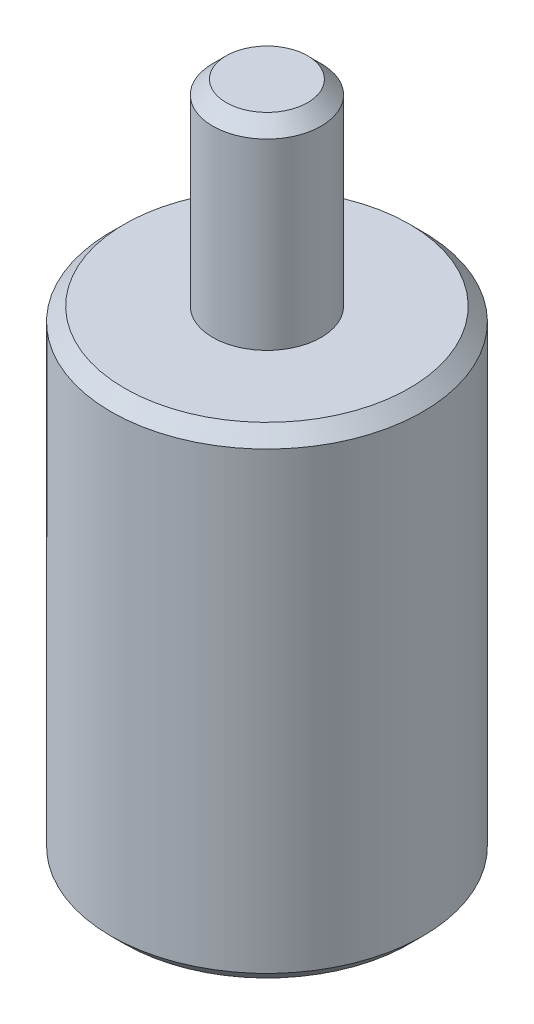
ISO-10303-21;
HEADER;
FILE_DESCRIPTION(('STEP AP214'),'2;1');
FILE_NAME('part.step','',(''),(''),'','','');
FILE_SCHEMA(('AUTOMOTIVE_DESIGN { 1 0 10303 214 1 1 1 1 }'));
ENDSEC;
DATA;
#1=APPLICATION_CONTEXT('core data for automotive mechanical design processes');
#2=APPLICATION_PROTOCOL_DEFINITION('international standard','automotive_design',2000,#1);
#3=PRODUCT_CONTEXT('',#1,'mechanical');
#4=PRODUCT('Part','Part','',(#3));
#5=PRODUCT_RELATED_PRODUCT_CATEGORY('part','',(#4));
#6=PRODUCT_DEFINITION_FORMATION('','',#4);
#7=PRODUCT_DEFINITION_CONTEXT('part definition',#1,'design');
#8=PRODUCT_DEFINITION('design','',#6,#7);
#9=PRODUCT_DEFINITION_SHAPE('','',#8);
#10=(LENGTH_UNIT() NAMED_UNIT(*) SI_UNIT(.MILLI.,.METRE.));
#11=(NAMED_UNIT(*) PLANE_ANGLE_UNIT() SI_UNIT($,.RADIAN.));
#12=(NAMED_UNIT(*) SI_UNIT($,.STERADIAN.) SOLID_ANGLE_UNIT());
#13=UNCERTAINTY_MEASURE_WITH_UNIT(LENGTH_MEASURE(1.E-05),#10,'distance_accuracy_value','');
#14=(GEOMETRIC_REPRESENTATION_CONTEXT(3) GLOBAL_UNCERTAINTY_ASSIGNED_CONTEXT((#13)) GLOBAL_UNIT_ASSIGNED_CONTEXT((#10,
#11,#12)) REPRESENTATION_CONTEXT('',''));
#15=CARTESIAN_POINT('',(0.,0.,0.));
#16=DIRECTION('',(0.,0.,1.));
#17=DIRECTION('',(1.,0.,0.));
#18=AXIS2_PLACEMENT_3D('',#15,#16,#17);
#19=CARTESIAN_POINT('',(0.,5.,0.));
#20=DIRECTION('',(0.,-1.,0.));
#21=DIRECTION('',(0.,0.,-1.));
#22=AXIS2_PLACEMENT_3D('',#19,#20,#21);
#23=CYLINDRICAL_SURFACE('',#22,1.15);
#24=CARTESIAN_POINT('',(0.,0.100000000000001,0.));
#25=DIRECTION('',(0.,1.,0.));
#26=DIRECTION('',(0.,0.,1.));
#27=AXIS2_PLACEMENT_3D('',#24,#25,#26);
#28=CIRCLE('',#27,1.15);
#29=CARTESIAN_POINT('',(0.,0.100000000000001,1.15));
#30=VERTEX_POINT('',#29);
#31=EDGE_CURVE('E74',#30,#30,#28,.T.);
#32=ORIENTED_EDGE('',*,*,#31,.T.);
#33=EDGE_LOOP('',(#32));
#34=FACE_BOUND('',#33,.T.);
#35=CARTESIAN_POINT('',(0.,3.45,0.));
#36=DIRECTION('',(0.,1.,0.));
#37=DIRECTION('',(0.,0.,1.));
#38=AXIS2_PLACEMENT_3D('',#35,#36,#37);
#39=CIRCLE('',#38,1.15);
#40=CARTESIAN_POINT('',(0.,3.45,1.15));
#41=VERTEX_POINT('',#40);
#42=EDGE_CURVE('E69',#41,#41,#39,.F.);
#43=ORIENTED_EDGE('',*,*,#42,.T.);
#44=EDGE_LOOP('',(#43));
#45=FACE_BOUND('',#44,.T.);
#46=ADVANCED_FACE('F48',(#34,#45),#23,.T.);
#47=CARTESIAN_POINT('',(0.,0.,0.));
#48=DIRECTION('',(0.,1.,0.));
#49=DIRECTION('',(0.,0.,1.));
#50=AXIS2_PLACEMENT_3D('',#47,#48,#49);
#51=PLANE('',#50);
#52=CARTESIAN_POINT('',(0.,0.,0.));
#53=DIRECTION('',(0.,1.,0.));
#54=DIRECTION('',(0.,0.,1.));
#55=AXIS2_PLACEMENT_3D('',#52,#53,#54);
#56=CIRCLE('',#55,0.800000000000001);
#57=CARTESIAN_POINT('',(0.,0.,0.800000000000001));
#58=VERTEX_POINT('',#57);
#59=EDGE_CURVE('E64',#58,#58,#56,.T.);
#60=ORIENTED_EDGE('',*,*,#59,.T.);
#61=EDGE_LOOP('',(#60));
#62=FACE_BOUND('',#61,.T.);
#63=CARTESIAN_POINT('',(0.,0.,0.));
#64=DIRECTION('',(0.,1.,0.));
#65=DIRECTION('',(0.,0.,1.));
#66=AXIS2_PLACEMENT_3D('',#63,#64,#65);
#67=CIRCLE('',#66,1.05);
#68=CARTESIAN_POINT('',(0.,0.,1.05));
#69=VERTEX_POINT('',#68);
#70=EDGE_CURVE('E77',#69,#69,#67,.F.);
#71=ORIENTED_EDGE('',*,*,#70,.T.);
#72=EDGE_LOOP('',(#71));
#73=FACE_BOUND('',#72,.T.);
#74=ADVANCED_FACE('F97',(#62,#73),#51,.F.);
#75=CARTESIAN_POINT('',(0.,3.55,0.));
#76=DIRECTION('',(0.,1.,0.));
#77=DIRECTION('',(0.,0.,1.));
#78=AXIS2_PLACEMENT_3D('',#75,#76,#77);
#79=PLANE('',#78);
#80=CARTESIAN_POINT('',(0.,3.55,0.));
#81=DIRECTION('',(0.,1.,0.));
#82=DIRECTION('',(0.,0.,1.));
#83=AXIS2_PLACEMENT_3D('',#80,#81,#82);
#84=CIRCLE('',#83,1.05);
#85=CARTESIAN_POINT('',(0.,3.55,1.05));
#86=VERTEX_POINT('',#85);
#87=EDGE_CURVE('E80',#86,#86,#84,.T.);
#88=ORIENTED_EDGE('',*,*,#87,.T.);
#89=EDGE_LOOP('',(#88));
#90=FACE_BOUND('',#89,.T.);
#91=CARTESIAN_POINT('',(0.,3.55,0.));
#92=DIRECTION('',(0.,1.,0.));
#93=DIRECTION('',(0.,0.,1.));
#94=AXIS2_PLACEMENT_3D('',#91,#92,#93);
#95=CIRCLE('',#94,0.4);
#96=CARTESIAN_POINT('',(0.,3.55,0.4));
#97=VERTEX_POINT('',#96);
#98=EDGE_CURVE('E66',#97,#97,#95,.T.);
#99=ORIENTED_EDGE('',*,*,#98,.F.);
#100=EDGE_LOOP('',(#99));
#101=FACE_BOUND('',#100,.T.);
#102=ADVANCED_FACE('F103',(#90,#101),#79,.T.);
#103=CARTESIAN_POINT('',(0.,3.55,0.));
#104=DIRECTION('',(0.,1.,0.));
#105=DIRECTION('',(0.,0.,1.));
#106=AXIS2_PLACEMENT_3D('',#103,#104,#105);
#107=CYLINDRICAL_SURFACE('',#106,0.4);
#108=CARTESIAN_POINT('',(0.,4.9,0.));
#109=DIRECTION('',(0.,1.,0.));
#110=DIRECTION('',(0.,0.,1.));
#111=AXIS2_PLACEMENT_3D('',#108,#109,#110);
#112=CIRCLE('',#111,0.4);
#113=CARTESIAN_POINT('',(0.,4.9,0.4));
#114=VERTEX_POINT('',#113);
#115=EDGE_CURVE('E14',#114,#114,#112,.F.);
#116=ORIENTED_EDGE('',*,*,#115,.T.);
#117=EDGE_LOOP('',(#116));
#118=FACE_BOUND('',#117,.T.);
#119=ORIENTED_EDGE('',*,*,#98,.T.);
#120=EDGE_LOOP('',(#119));
#121=FACE_BOUND('',#120,.T.);
#122=ADVANCED_FACE('F113',(#118,#121),#107,.T.);
#123=CARTESIAN_POINT('',(0.,5.,0.));
#124=DIRECTION('',(0.,1.,0.));
#125=DIRECTION('',(0.,0.,1.));
#126=AXIS2_PLACEMENT_3D('',#123,#124,#125);
#127=PLANE('',#126);
#128=CARTESIAN_POINT('',(0.,5.,0.));
#129=DIRECTION('',(0.,1.,0.));
#130=DIRECTION('',(0.,0.,1.));
#131=AXIS2_PLACEMENT_3D('',#128,#129,#130);
#132=CIRCLE('',#131,0.3);
#133=CARTESIAN_POINT('',(0.,5.,0.3));
#134=VERTEX_POINT('',#133);
#135=EDGE_CURVE('E55',#134,#134,#132,.T.);
#136=ORIENTED_EDGE('',*,*,#135,.T.);
#137=EDGE_LOOP('',(#136));
#138=FACE_BOUND('',#137,.T.);
#139=ADVANCED_FACE('F85',(#138),#127,.T.);
#140=CARTESIAN_POINT('',(0.,0.100000000000001,0.));
#141=DIRECTION('',(0.,1.,0.));
#142=DIRECTION('',(0.,0.,1.));
#143=AXIS2_PLACEMENT_3D('',#140,#141,#142);
#144=CONICAL_SURFACE('',#143,1.15,0.785398163397448);
#145=ORIENTED_EDGE('',*,*,#70,.F.);
#146=EDGE_LOOP('',(#145));
#147=FACE_BOUND('',#146,.T.);
#148=ORIENTED_EDGE('',*,*,#31,.F.);
#149=EDGE_LOOP('',(#148));
#150=FACE_BOUND('',#149,.T.);
#151=ADVANCED_FACE('F93',(#147,#150),#144,.T.);
#152=CARTESIAN_POINT('',(0.,3.55,0.));
#153=DIRECTION('',(0.,-1.,0.));
#154=DIRECTION('',(0.,0.,-1.));
#155=AXIS2_PLACEMENT_3D('',#152,#153,#154);
#156=CONICAL_SURFACE('',#155,1.05,0.78539816339745);
#157=ORIENTED_EDGE('',*,*,#42,.F.);
#158=EDGE_LOOP('',(#157));
#159=FACE_BOUND('',#158,.T.);
#160=ORIENTED_EDGE('',*,*,#87,.F.);
#161=EDGE_LOOP('',(#160));
#162=FACE_BOUND('',#161,.T.);
#163=ADVANCED_FACE('F88',(#159,#162),#156,.T.);
#164=CARTESIAN_POINT('',(0.,5.,0.));
#165=DIRECTION('',(0.,-1.,0.));
#166=DIRECTION('',(0.,0.,-1.));
#167=AXIS2_PLACEMENT_3D('',#164,#165,#166);
#168=CONICAL_SURFACE('',#167,0.3,0.785398163397448);
#169=ORIENTED_EDGE('',*,*,#115,.F.);
#170=EDGE_LOOP('',(#169));
#171=FACE_BOUND('',#170,.T.);
#172=ORIENTED_EDGE('',*,*,#135,.F.);
#173=EDGE_LOOP('',(#172));
#174=FACE_BOUND('',#173,.T.);
#175=ADVANCED_FACE('F50',(#171,#174),#168,.T.);
#176=CARTESIAN_POINT('',(0.,0.,0.));
#177=DIRECTION('',(0.,-1.,0.));
#178=DIRECTION('',(0.,0.,-1.));
#179=AXIS2_PLACEMENT_3D('',#176,#177,#178);
#180=CONICAL_SURFACE('',#179,0.800000000000001,0.785398163397443);
#181=CARTESIAN_POINT('',(0.,0.800000000000008,0.));
#182=VERTEX_POINT('',#181);
#183=VERTEX_LOOP('',#182);
#184=FACE_BOUND('',#183,.T.);
#185=ORIENTED_EDGE('',*,*,#59,.F.);
#186=EDGE_LOOP('',(#185));
#187=FACE_BOUND('',#186,.T.);
#188=ADVANCED_FACE('F58',(#184,#187),#180,.F.);
#189=CLOSED_SHELL('',(#46,#74,#102,#122,#139,#151,#163,#175,#188));
#190=MANIFOLD_SOLID_BREP('B2',#189);
#191=ADVANCED_BREP_SHAPE_REPRESENTATION('',(#18,#190),#14);
#192=SHAPE_DEFINITION_REPRESENTATION(#9,#191);
ENDSEC;
END-ISO-10303-21;
